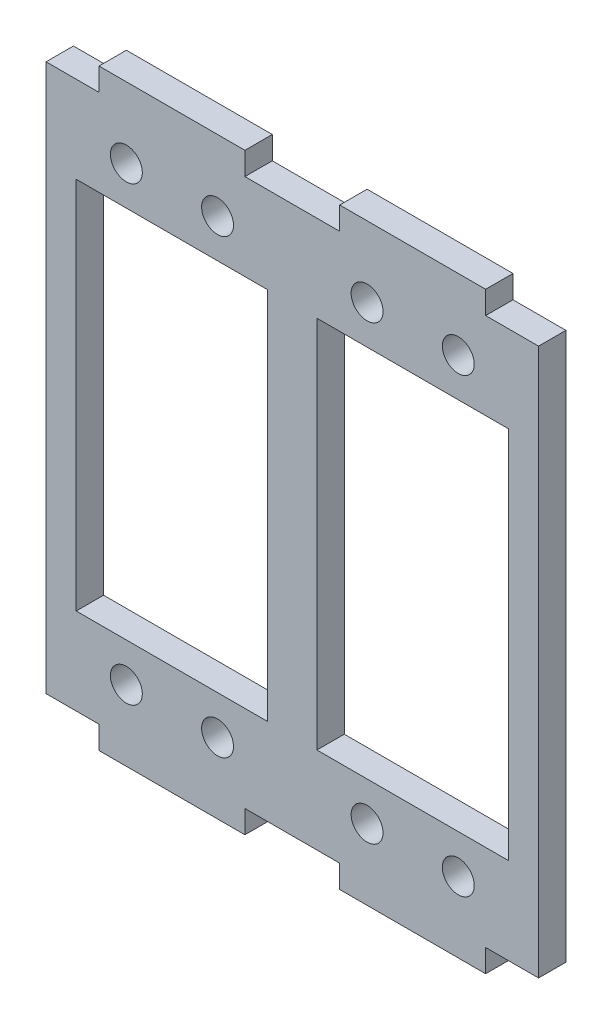
ISO-10303-21;
HEADER;
FILE_DESCRIPTION(('STEP AP214'),'2;1');
FILE_NAME('part.step','',(''),(''),'','','');
FILE_SCHEMA(('AUTOMOTIVE_DESIGN { 1 0 10303 214 1 1 1 1 }'));
ENDSEC;
DATA;
#1=APPLICATION_CONTEXT('core data for automotive mechanical design processes');
#2=APPLICATION_PROTOCOL_DEFINITION('international standard','automotive_design',2000,#1);
#3=PRODUCT_CONTEXT('',#1,'mechanical');
#4=PRODUCT('Part','Part','',(#3));
#5=PRODUCT_RELATED_PRODUCT_CATEGORY('part','',(#4));
#6=PRODUCT_DEFINITION_FORMATION('','',#4);
#7=PRODUCT_DEFINITION_CONTEXT('part definition',#1,'design');
#8=PRODUCT_DEFINITION('design','',#6,#7);
#9=PRODUCT_DEFINITION_SHAPE('','',#8);
#10=(LENGTH_UNIT() NAMED_UNIT(*) SI_UNIT(.MILLI.,.METRE.));
#11=(NAMED_UNIT(*) PLANE_ANGLE_UNIT() SI_UNIT($,.RADIAN.));
#12=(NAMED_UNIT(*) SI_UNIT($,.STERADIAN.) SOLID_ANGLE_UNIT());
#13=UNCERTAINTY_MEASURE_WITH_UNIT(LENGTH_MEASURE(1.E-05),#10,'distance_accuracy_value','');
#14=(GEOMETRIC_REPRESENTATION_CONTEXT(3) GLOBAL_UNCERTAINTY_ASSIGNED_CONTEXT((#13)) GLOBAL_UNIT_ASSIGNED_CONTEXT((#10,
#11,#12)) REPRESENTATION_CONTEXT('',''));
#15=CARTESIAN_POINT('',(0.,0.,0.));
#16=DIRECTION('',(0.,0.,1.));
#17=DIRECTION('',(1.,0.,0.));
#18=AXIS2_PLACEMENT_3D('',#15,#16,#17);
#19=CARTESIAN_POINT('',(0.,-30.6,-3.));
#20=DIRECTION('',(0.,1.,0.));
#21=DIRECTION('',(-1.,0.,0.));
#22=AXIS2_PLACEMENT_3D('',#19,#20,#21);
#23=PLANE('',#22);
#24=DIRECTION('',(-1.,0.,0.));
#25=VECTOR('',#24,1.);
#26=CARTESIAN_POINT('',(0.,-30.6,0.));
#27=LINE('',#26,#25);
#28=CARTESIAN_POINT('',(23.69729,-30.6,0.));
#29=VERTEX_POINT('',#28);
#30=CARTESIAN_POINT('',(2.69728999999997,-30.6,0.));
#31=VERTEX_POINT('',#30);
#32=EDGE_CURVE('E340',#29,#31,#27,.T.);
#33=ORIENTED_EDGE('',*,*,#32,.F.);
#34=DIRECTION('',(0.,0.,1.));
#35=VECTOR('',#34,1.);
#36=CARTESIAN_POINT('',(23.69729,-30.6,-3.));
#37=LINE('',#36,#35);
#38=CARTESIAN_POINT('',(23.69729,-30.6,-3.));
#39=VERTEX_POINT('',#38);
#40=EDGE_CURVE('E11',#39,#29,#37,.T.);
#41=ORIENTED_EDGE('',*,*,#40,.F.);
#42=DIRECTION('',(-1.,0.,0.));
#43=VECTOR('',#42,1.);
#44=CARTESIAN_POINT('',(0.,-30.6,-3.));
#45=LINE('',#44,#43);
#46=CARTESIAN_POINT('',(2.69728999999997,-30.6,-3.));
#47=VERTEX_POINT('',#46);
#48=EDGE_CURVE('E250',#39,#47,#45,.T.);
#49=ORIENTED_EDGE('',*,*,#48,.T.);
#50=DIRECTION('',(0.,0.,1.));
#51=VECTOR('',#50,1.);
#52=CARTESIAN_POINT('',(2.69728999999997,-30.6,-3.));
#53=LINE('',#52,#51);
#54=EDGE_CURVE('E247',#47,#31,#53,.T.);
#55=ORIENTED_EDGE('',*,*,#54,.T.);
#56=EDGE_LOOP('',(#33,#41,#49,#55));
#57=FACE_BOUND('',#56,.T.);
#58=ADVANCED_FACE('F38',(#57),#23,.T.);
#59=CARTESIAN_POINT('',(23.69729,0.,-3.));
#60=DIRECTION('',(1.,0.,0.));
#61=DIRECTION('',(0.,0.,-1.));
#62=AXIS2_PLACEMENT_3D('',#59,#60,#61);
#63=PLANE('',#62);
#64=DIRECTION('',(0.,1.,0.));
#65=VECTOR('',#64,1.);
#66=CARTESIAN_POINT('',(23.69729,0.,0.));
#67=LINE('',#66,#65);
#68=CARTESIAN_POINT('',(23.69729,10.4,0.));
#69=VERTEX_POINT('',#68);
#70=EDGE_CURVE('E346',#29,#69,#67,.T.);
#71=ORIENTED_EDGE('',*,*,#70,.T.);
#72=DIRECTION('',(0.,0.,1.));
#73=VECTOR('',#72,1.);
#74=CARTESIAN_POINT('',(23.69729,10.4,-3.));
#75=LINE('',#74,#73);
#76=CARTESIAN_POINT('',(23.69729,10.4,-3.));
#77=VERTEX_POINT('',#76);
#78=EDGE_CURVE('E48',#77,#69,#75,.T.);
#79=ORIENTED_EDGE('',*,*,#78,.F.);
#80=DIRECTION('',(0.,1.,0.));
#81=VECTOR('',#80,1.);
#82=CARTESIAN_POINT('',(23.69729,0.,-3.));
#83=LINE('',#82,#81);
#84=EDGE_CURVE('E239',#39,#77,#83,.T.);
#85=ORIENTED_EDGE('',*,*,#84,.F.);
#86=ORIENTED_EDGE('',*,*,#40,.T.);
#87=EDGE_LOOP('',(#71,#79,#85,#86));
#88=FACE_BOUND('',#87,.T.);
#89=ADVANCED_FACE('F558',(#88),#63,.F.);
#90=CARTESIAN_POINT('',(0.,10.4,-3.));
#91=DIRECTION('',(0.,1.,0.));
#92=DIRECTION('',(-1.,0.,0.));
#93=AXIS2_PLACEMENT_3D('',#90,#91,#92);
#94=PLANE('',#93);
#95=DIRECTION('',(-1.,0.,0.));
#96=VECTOR('',#95,1.);
#97=CARTESIAN_POINT('',(0.,10.4,0.));
#98=LINE('',#97,#96);
#99=CARTESIAN_POINT('',(2.69728999999997,10.4,0.));
#100=VERTEX_POINT('',#99);
#101=EDGE_CURVE('E145',#69,#100,#98,.T.);
#102=ORIENTED_EDGE('',*,*,#101,.T.);
#103=DIRECTION('',(0.,0.,1.));
#104=VECTOR('',#103,1.);
#105=CARTESIAN_POINT('',(2.69728999999997,10.4,-3.));
#106=LINE('',#105,#104);
#107=CARTESIAN_POINT('',(2.69728999999997,10.4,-3.));
#108=VERTEX_POINT('',#107);
#109=EDGE_CURVE('E243',#108,#100,#106,.T.);
#110=ORIENTED_EDGE('',*,*,#109,.F.);
#111=DIRECTION('',(-1.,0.,0.));
#112=VECTOR('',#111,1.);
#113=CARTESIAN_POINT('',(0.,10.4,-3.));
#114=LINE('',#113,#112);
#115=EDGE_CURVE('E233',#77,#108,#114,.T.);
#116=ORIENTED_EDGE('',*,*,#115,.F.);
#117=ORIENTED_EDGE('',*,*,#78,.T.);
#118=EDGE_LOOP('',(#102,#110,#116,#117));
#119=FACE_BOUND('',#118,.T.);
#120=ADVANCED_FACE('F244',(#119),#94,.F.);
#121=CARTESIAN_POINT('',(0.,-30.6,-3.));
#122=DIRECTION('',(0.,1.,0.));
#123=DIRECTION('',(-1.,0.,0.));
#124=AXIS2_PLACEMENT_3D('',#121,#122,#123);
#125=PLANE('',#124);
#126=DIRECTION('',(-1.,0.,0.));
#127=VECTOR('',#126,1.);
#128=CARTESIAN_POINT('',(0.,-30.6,0.));
#129=LINE('',#128,#127);
#130=CARTESIAN_POINT('',(-2.69729000000003,-30.6,0.));
#131=VERTEX_POINT('',#130);
#132=CARTESIAN_POINT('',(-23.69729,-30.6,0.));
#133=VERTEX_POINT('',#132);
#134=EDGE_CURVE('E328',#131,#133,#129,.T.);
#135=ORIENTED_EDGE('',*,*,#134,.F.);
#136=DIRECTION('',(0.,0.,1.));
#137=VECTOR('',#136,1.);
#138=CARTESIAN_POINT('',(-2.69729000000003,-30.6,-3.));
#139=LINE('',#138,#137);
#140=CARTESIAN_POINT('',(-2.69729000000003,-30.6,-3.));
#141=VERTEX_POINT('',#140);
#142=EDGE_CURVE('E351',#141,#131,#139,.T.);
#143=ORIENTED_EDGE('',*,*,#142,.F.);
#144=DIRECTION('',(-1.,0.,0.));
#145=VECTOR('',#144,1.);
#146=CARTESIAN_POINT('',(0.,-30.6,-3.));
#147=LINE('',#146,#145);
#148=CARTESIAN_POINT('',(-23.69729,-30.6,-3.));
#149=VERTEX_POINT('',#148);
#150=EDGE_CURVE('E448',#141,#149,#147,.T.);
#151=ORIENTED_EDGE('',*,*,#150,.T.);
#152=DIRECTION('',(0.,0.,1.));
#153=VECTOR('',#152,1.);
#154=CARTESIAN_POINT('',(-23.69729,-30.6,-3.));
#155=LINE('',#154,#153);
#156=EDGE_CURVE('E358',#149,#133,#155,.T.);
#157=ORIENTED_EDGE('',*,*,#156,.T.);
#158=EDGE_LOOP('',(#135,#143,#151,#157));
#159=FACE_BOUND('',#158,.T.);
#160=ADVANCED_FACE('F571',(#159),#125,.T.);
#161=CARTESIAN_POINT('',(-2.69729000000003,0.,-3.));
#162=DIRECTION('',(1.,0.,0.));
#163=DIRECTION('',(0.,0.,-1.));
#164=AXIS2_PLACEMENT_3D('',#161,#162,#163);
#165=PLANE('',#164);
#166=DIRECTION('',(0.,1.,0.));
#167=VECTOR('',#166,1.);
#168=CARTESIAN_POINT('',(-2.69729000000003,0.,0.));
#169=LINE('',#168,#167);
#170=CARTESIAN_POINT('',(-2.69729000000003,10.4,0.));
#171=VERTEX_POINT('',#170);
#172=EDGE_CURVE('E337',#131,#171,#169,.T.);
#173=ORIENTED_EDGE('',*,*,#172,.T.);
#174=DIRECTION('',(0.,0.,1.));
#175=VECTOR('',#174,1.);
#176=CARTESIAN_POINT('',(-2.69729000000003,10.4,-3.));
#177=LINE('',#176,#175);
#178=CARTESIAN_POINT('',(-2.69729000000003,10.4,-3.));
#179=VERTEX_POINT('',#178);
#180=EDGE_CURVE('E353',#179,#171,#177,.T.);
#181=ORIENTED_EDGE('',*,*,#180,.F.);
#182=DIRECTION('',(0.,1.,0.));
#183=VECTOR('',#182,1.);
#184=CARTESIAN_POINT('',(-2.69729000000003,0.,-3.));
#185=LINE('',#184,#183);
#186=EDGE_CURVE('E252',#141,#179,#185,.T.);
#187=ORIENTED_EDGE('',*,*,#186,.F.);
#188=ORIENTED_EDGE('',*,*,#142,.T.);
#189=EDGE_LOOP('',(#173,#181,#187,#188));
#190=FACE_BOUND('',#189,.T.);
#191=ADVANCED_FACE('F567',(#190),#165,.F.);
#192=CARTESIAN_POINT('',(0.,10.4,-3.));
#193=DIRECTION('',(0.,1.,0.));
#194=DIRECTION('',(-1.,0.,0.));
#195=AXIS2_PLACEMENT_3D('',#192,#193,#194);
#196=PLANE('',#195);
#197=DIRECTION('',(-1.,0.,0.));
#198=VECTOR('',#197,1.);
#199=CARTESIAN_POINT('',(0.,10.4,0.));
#200=LINE('',#199,#198);
#201=CARTESIAN_POINT('',(-23.69729,10.4,0.));
#202=VERTEX_POINT('',#201);
#203=EDGE_CURVE('E334',#171,#202,#200,.T.);
#204=ORIENTED_EDGE('',*,*,#203,.T.);
#205=DIRECTION('',(0.,0.,1.));
#206=VECTOR('',#205,1.);
#207=CARTESIAN_POINT('',(-23.69729,10.4,-3.));
#208=LINE('',#207,#206);
#209=CARTESIAN_POINT('',(-23.69729,10.4,-3.));
#210=VERTEX_POINT('',#209);
#211=EDGE_CURVE('E356',#210,#202,#208,.T.);
#212=ORIENTED_EDGE('',*,*,#211,.F.);
#213=DIRECTION('',(-1.,0.,0.));
#214=VECTOR('',#213,1.);
#215=CARTESIAN_POINT('',(0.,10.4,-3.));
#216=LINE('',#215,#214);
#217=EDGE_CURVE('E928',#179,#210,#216,.T.);
#218=ORIENTED_EDGE('',*,*,#217,.F.);
#219=ORIENTED_EDGE('',*,*,#180,.T.);
#220=EDGE_LOOP('',(#204,#212,#218,#219));
#221=FACE_BOUND('',#220,.T.);
#222=ADVANCED_FACE('F570',(#221),#196,.F.);
#223=CARTESIAN_POINT('',(-27.,0.,-3.));
#224=DIRECTION('',(1.,0.,0.));
#225=DIRECTION('',(0.,1.,0.));
#226=AXIS2_PLACEMENT_3D('',#223,#224,#225);
#227=PLANE('',#226);
#228=DIRECTION('',(0.,1.,0.));
#229=VECTOR('',#228,1.);
#230=CARTESIAN_POINT('',(-27.,0.,0.));
#231=LINE('',#230,#229);
#232=CARTESIAN_POINT('',(-27.,-40.1,0.));
#233=VERTEX_POINT('',#232);
#234=CARTESIAN_POINT('',(-27.,19.9,0.));
#235=VERTEX_POINT('',#234);
#236=EDGE_CURVE('E281',#233,#235,#231,.T.);
#237=ORIENTED_EDGE('',*,*,#236,.T.);
#238=DIRECTION('',(0.,0.,1.));
#239=VECTOR('',#238,1.);
#240=CARTESIAN_POINT('',(-27.,19.9,-3.));
#241=LINE('',#240,#239);
#242=CARTESIAN_POINT('',(-27.,19.9,-3.));
#243=VERTEX_POINT('',#242);
#244=EDGE_CURVE('E360',#243,#235,#241,.T.);
#245=ORIENTED_EDGE('',*,*,#244,.F.);
#246=DIRECTION('',(0.,1.,0.));
#247=VECTOR('',#246,1.);
#248=CARTESIAN_POINT('',(-27.,0.,-3.));
#249=LINE('',#248,#247);
#250=CARTESIAN_POINT('',(-27.,-40.1,-3.));
#251=VERTEX_POINT('',#250);
#252=EDGE_CURVE('E409',#251,#243,#249,.T.);
#253=ORIENTED_EDGE('',*,*,#252,.F.);
#254=DIRECTION('',(0.,0.,1.));
#255=VECTOR('',#254,1.);
#256=CARTESIAN_POINT('',(-27.,-40.1,-3.));
#257=LINE('',#256,#255);
#258=EDGE_CURVE('E42',#251,#233,#257,.T.);
#259=ORIENTED_EDGE('',*,*,#258,.T.);
#260=EDGE_LOOP('',(#237,#245,#253,#259));
#261=FACE_BOUND('',#260,.T.);
#262=ADVANCED_FACE('F406',(#261),#227,.F.);
#263=CARTESIAN_POINT('',(0.,19.9,-3.));
#264=DIRECTION('',(0.,1.,0.));
#265=DIRECTION('',(-1.,0.,0.));
#266=AXIS2_PLACEMENT_3D('',#263,#264,#265);
#267=PLANE('',#266);
#268=DIRECTION('',(-1.,0.,0.));
#269=VECTOR('',#268,1.);
#270=CARTESIAN_POINT('',(0.,19.9,0.));
#271=LINE('',#270,#269);
#272=CARTESIAN_POINT('',(-21.19729,19.9,0.));
#273=VERTEX_POINT('',#272);
#274=EDGE_CURVE('E313',#273,#235,#271,.T.);
#275=ORIENTED_EDGE('',*,*,#274,.F.);
#276=DIRECTION('',(0.,0.,1.));
#277=VECTOR('',#276,1.);
#278=CARTESIAN_POINT('',(-21.19729,19.9,-3.));
#279=LINE('',#278,#277);
#280=CARTESIAN_POINT('',(-21.19729,19.9,-3.));
#281=VERTEX_POINT('',#280);
#282=EDGE_CURVE('E362',#281,#273,#279,.T.);
#283=ORIENTED_EDGE('',*,*,#282,.F.);
#284=DIRECTION('',(-1.,0.,0.));
#285=VECTOR('',#284,1.);
#286=CARTESIAN_POINT('',(0.,19.9,-3.));
#287=LINE('',#286,#285);
#288=EDGE_CURVE('E447',#281,#243,#287,.T.);
#289=ORIENTED_EDGE('',*,*,#288,.T.);
#290=ORIENTED_EDGE('',*,*,#244,.T.);
#291=EDGE_LOOP('',(#275,#283,#289,#290));
#292=FACE_BOUND('',#291,.T.);
#293=ADVANCED_FACE('F446',(#292),#267,.T.);
#294=CARTESIAN_POINT('',(-21.19729,0.,-3.));
#295=DIRECTION('',(1.,0.,0.));
#296=DIRECTION('',(0.,0.,-1.));
#297=AXIS2_PLACEMENT_3D('',#294,#295,#296);
#298=PLANE('',#297);
#299=DIRECTION('',(0.,1.,0.));
#300=VECTOR('',#299,1.);
#301=CARTESIAN_POINT('',(-21.19729,0.,0.));
#302=LINE('',#301,#300);
#303=CARTESIAN_POINT('',(-21.19729,22.4,0.));
#304=VERTEX_POINT('',#303);
#305=EDGE_CURVE('E326',#273,#304,#302,.T.);
#306=ORIENTED_EDGE('',*,*,#305,.T.);
#307=DIRECTION('',(0.,0.,1.));
#308=VECTOR('',#307,1.);
#309=CARTESIAN_POINT('',(-21.19729,22.4,-3.));
#310=LINE('',#309,#308);
#311=CARTESIAN_POINT('',(-21.19729,22.4,-3.));
#312=VERTEX_POINT('',#311);
#313=EDGE_CURVE('E364',#312,#304,#310,.T.);
#314=ORIENTED_EDGE('',*,*,#313,.F.);
#315=DIRECTION('',(0.,1.,0.));
#316=VECTOR('',#315,1.);
#317=CARTESIAN_POINT('',(-21.19729,0.,-3.));
#318=LINE('',#317,#316);
#319=EDGE_CURVE('E443',#281,#312,#318,.T.);
#320=ORIENTED_EDGE('',*,*,#319,.F.);
#321=ORIENTED_EDGE('',*,*,#282,.T.);
#322=EDGE_LOOP('',(#306,#314,#320,#321));
#323=FACE_BOUND('',#322,.T.);
#324=ADVANCED_FACE('F442',(#323),#298,.F.);
#325=CARTESIAN_POINT('',(0.,22.4,-3.));
#326=DIRECTION('',(0.,-1.,0.));
#327=DIRECTION('',(0.,0.,-1.));
#328=AXIS2_PLACEMENT_3D('',#325,#326,#327);
#329=PLANE('',#328);
#330=DIRECTION('',(1.,0.,0.));
#331=VECTOR('',#330,1.);
#332=CARTESIAN_POINT('',(0.,22.4,0.));
#333=LINE('',#332,#331);
#334=CARTESIAN_POINT('',(-5.19729000000003,22.4,0.));
#335=VERTEX_POINT('',#334);
#336=EDGE_CURVE('E324',#304,#335,#333,.T.);
#337=ORIENTED_EDGE('',*,*,#336,.T.);
#338=DIRECTION('',(0.,0.,1.));
#339=VECTOR('',#338,1.);
#340=CARTESIAN_POINT('',(-5.19729000000003,22.4,-3.));
#341=LINE('',#340,#339);
#342=CARTESIAN_POINT('',(-5.19729000000003,22.4,-3.));
#343=VERTEX_POINT('',#342);
#344=EDGE_CURVE('E367',#343,#335,#341,.T.);
#345=ORIENTED_EDGE('',*,*,#344,.F.);
#346=DIRECTION('',(1.,0.,0.));
#347=VECTOR('',#346,1.);
#348=CARTESIAN_POINT('',(0.,22.4,-3.));
#349=LINE('',#348,#347);
#350=EDGE_CURVE('E438',#312,#343,#349,.T.);
#351=ORIENTED_EDGE('',*,*,#350,.F.);
#352=ORIENTED_EDGE('',*,*,#313,.T.);
#353=EDGE_LOOP('',(#337,#345,#351,#352));
#354=FACE_BOUND('',#353,.T.);
#355=ADVANCED_FACE('F437',(#354),#329,.F.);
#356=CARTESIAN_POINT('',(-5.19729000000003,0.,-3.));
#357=DIRECTION('',(-1.,0.,0.));
#358=DIRECTION('',(0.,0.,1.));
#359=AXIS2_PLACEMENT_3D('',#356,#357,#358);
#360=PLANE('',#359);
#361=DIRECTION('',(0.,-1.,0.));
#362=VECTOR('',#361,1.);
#363=CARTESIAN_POINT('',(-5.19729000000003,0.,0.));
#364=LINE('',#363,#362);
#365=CARTESIAN_POINT('',(-5.19729000000003,19.9,0.));
#366=VERTEX_POINT('',#365);
#367=EDGE_CURVE('E321',#335,#366,#364,.T.);
#368=ORIENTED_EDGE('',*,*,#367,.T.);
#369=DIRECTION('',(0.,0.,1.));
#370=VECTOR('',#369,1.);
#371=CARTESIAN_POINT('',(-5.19729000000003,19.9,-3.));
#372=LINE('',#371,#370);
#373=CARTESIAN_POINT('',(-5.19729000000003,19.9,-3.));
#374=VERTEX_POINT('',#373);
#375=EDGE_CURVE('E370',#374,#366,#372,.T.);
#376=ORIENTED_EDGE('',*,*,#375,.F.);
#377=DIRECTION('',(0.,-1.,0.));
#378=VECTOR('',#377,1.);
#379=CARTESIAN_POINT('',(-5.19729000000003,0.,-3.));
#380=LINE('',#379,#378);
#381=EDGE_CURVE('E434',#343,#374,#380,.T.);
#382=ORIENTED_EDGE('',*,*,#381,.F.);
#383=ORIENTED_EDGE('',*,*,#344,.T.);
#384=EDGE_LOOP('',(#368,#376,#382,#383));
#385=FACE_BOUND('',#384,.T.);
#386=ADVANCED_FACE('F432',(#385),#360,.F.);
#387=CARTESIAN_POINT('',(5.19728999999997,19.9,0.));
#388=VERTEX_POINT('',#387);
#389=EDGE_CURVE('E314',#388,#366,#271,.T.);
#390=ORIENTED_EDGE('',*,*,#389,.F.);
#391=DIRECTION('',(0.,0.,1.));
#392=VECTOR('',#391,1.);
#393=CARTESIAN_POINT('',(5.19728999999997,19.9,-3.));
#394=LINE('',#393,#392);
#395=CARTESIAN_POINT('',(5.19728999999997,19.9,-3.));
#396=VERTEX_POINT('',#395);
#397=EDGE_CURVE('E372',#396,#388,#394,.T.);
#398=ORIENTED_EDGE('',*,*,#397,.F.);
#399=EDGE_CURVE('E429',#396,#374,#287,.T.);
#400=ORIENTED_EDGE('',*,*,#399,.T.);
#401=ORIENTED_EDGE('',*,*,#375,.T.);
#402=EDGE_LOOP('',(#390,#398,#400,#401));
#403=FACE_BOUND('',#402,.T.);
#404=ADVANCED_FACE('F424',(#403),#267,.T.);
#405=CARTESIAN_POINT('',(5.19728999999997,0.,-3.));
#406=DIRECTION('',(1.,0.,0.));
#407=DIRECTION('',(0.,0.,-1.));
#408=AXIS2_PLACEMENT_3D('',#405,#406,#407);
#409=PLANE('',#408);
#410=DIRECTION('',(0.,1.,0.));
#411=VECTOR('',#410,1.);
#412=CARTESIAN_POINT('',(5.19728999999997,0.,0.));
#413=LINE('',#412,#411);
#414=CARTESIAN_POINT('',(5.19728999999997,22.4,0.));
#415=VERTEX_POINT('',#414);
#416=EDGE_CURVE('E319',#388,#415,#413,.T.);
#417=ORIENTED_EDGE('',*,*,#416,.T.);
#418=DIRECTION('',(0.,0.,1.));
#419=VECTOR('',#418,1.);
#420=CARTESIAN_POINT('',(5.19728999999997,22.4,-3.));
#421=LINE('',#420,#419);
#422=CARTESIAN_POINT('',(5.19728999999997,22.4,-3.));
#423=VERTEX_POINT('',#422);
#424=EDGE_CURVE('E374',#423,#415,#421,.T.);
#425=ORIENTED_EDGE('',*,*,#424,.F.);
#426=DIRECTION('',(0.,1.,0.));
#427=VECTOR('',#426,1.);
#428=CARTESIAN_POINT('',(5.19728999999997,0.,-3.));
#429=LINE('',#428,#427);
#430=EDGE_CURVE('E457',#396,#423,#429,.T.);
#431=ORIENTED_EDGE('',*,*,#430,.F.);
#432=ORIENTED_EDGE('',*,*,#397,.T.);
#433=EDGE_LOOP('',(#417,#425,#431,#432));
#434=FACE_BOUND('',#433,.T.);
#435=ADVANCED_FACE('F592',(#434),#409,.F.);
#436=CARTESIAN_POINT('',(0.,22.4,-3.));
#437=DIRECTION('',(0.,-1.,0.));
#438=DIRECTION('',(1.,0.,0.));
#439=AXIS2_PLACEMENT_3D('',#436,#437,#438);
#440=PLANE('',#439);
#441=DIRECTION('',(1.,0.,0.));
#442=VECTOR('',#441,1.);
#443=CARTESIAN_POINT('',(0.,22.4,0.));
#444=LINE('',#443,#442);
#445=CARTESIAN_POINT('',(21.19729,22.4,0.));
#446=VERTEX_POINT('',#445);
#447=EDGE_CURVE('E317',#415,#446,#444,.T.);
#448=ORIENTED_EDGE('',*,*,#447,.T.);
#449=DIRECTION('',(0.,0.,1.));
#450=VECTOR('',#449,1.);
#451=CARTESIAN_POINT('',(21.19729,22.4,-3.));
#452=LINE('',#451,#450);
#453=CARTESIAN_POINT('',(21.19729,22.4,-3.));
#454=VERTEX_POINT('',#453);
#455=EDGE_CURVE('E377',#454,#446,#452,.T.);
#456=ORIENTED_EDGE('',*,*,#455,.F.);
#457=DIRECTION('',(1.,0.,0.));
#458=VECTOR('',#457,1.);
#459=CARTESIAN_POINT('',(0.,22.4,-3.));
#460=LINE('',#459,#458);
#461=EDGE_CURVE('E463',#423,#454,#460,.T.);
#462=ORIENTED_EDGE('',*,*,#461,.F.);
#463=ORIENTED_EDGE('',*,*,#424,.T.);
#464=EDGE_LOOP('',(#448,#456,#462,#463));
#465=FACE_BOUND('',#464,.T.);
#466=ADVANCED_FACE('F595',(#465),#440,.F.);
#467=CARTESIAN_POINT('',(21.19729,0.,-3.));
#468=DIRECTION('',(-1.,0.,0.));
#469=DIRECTION('',(0.,0.,1.));
#470=AXIS2_PLACEMENT_3D('',#467,#468,#469);
#471=PLANE('',#470);
#472=DIRECTION('',(0.,-1.,0.));
#473=VECTOR('',#472,1.);
#474=CARTESIAN_POINT('',(21.19729,0.,0.));
#475=LINE('',#474,#473);
#476=CARTESIAN_POINT('',(21.19729,19.9,0.));
#477=VERTEX_POINT('',#476);
#478=EDGE_CURVE('E312',#446,#477,#475,.T.);
#479=ORIENTED_EDGE('',*,*,#478,.T.);
#480=DIRECTION('',(0.,0.,1.));
#481=VECTOR('',#480,1.);
#482=CARTESIAN_POINT('',(21.19729,19.9,-3.));
#483=LINE('',#482,#481);
#484=CARTESIAN_POINT('',(21.19729,19.9,-3.));
#485=VERTEX_POINT('',#484);
#486=EDGE_CURVE('E380',#485,#477,#483,.T.);
#487=ORIENTED_EDGE('',*,*,#486,.F.);
#488=DIRECTION('',(0.,-1.,0.));
#489=VECTOR('',#488,1.);
#490=CARTESIAN_POINT('',(21.19729,0.,-3.));
#491=LINE('',#490,#489);
#492=EDGE_CURVE('E459',#454,#485,#491,.T.);
#493=ORIENTED_EDGE('',*,*,#492,.F.);
#494=ORIENTED_EDGE('',*,*,#455,.T.);
#495=EDGE_LOOP('',(#479,#487,#493,#494));
#496=FACE_BOUND('',#495,.T.);
#497=ADVANCED_FACE('F599',(#496),#471,.F.);
#498=CARTESIAN_POINT('',(27.,19.9,0.));
#499=VERTEX_POINT('',#498);
#500=EDGE_CURVE('E309',#499,#477,#271,.T.);
#501=ORIENTED_EDGE('',*,*,#500,.F.);
#502=DIRECTION('',(0.,0.,1.));
#503=VECTOR('',#502,1.);
#504=CARTESIAN_POINT('',(27.,19.9,-3.));
#505=LINE('',#504,#503);
#506=CARTESIAN_POINT('',(27.,19.9,-3.));
#507=VERTEX_POINT('',#506);
#508=EDGE_CURVE('E382',#507,#499,#505,.T.);
#509=ORIENTED_EDGE('',*,*,#508,.F.);
#510=EDGE_CURVE('E450',#507,#485,#287,.T.);
#511=ORIENTED_EDGE('',*,*,#510,.T.);
#512=ORIENTED_EDGE('',*,*,#486,.T.);
#513=EDGE_LOOP('',(#501,#509,#511,#512));
#514=FACE_BOUND('',#513,.T.);
#515=ADVANCED_FACE('F585',(#514),#267,.T.);
#516=CARTESIAN_POINT('',(27.,0.,-3.));
#517=DIRECTION('',(1.,0.,0.));
#518=DIRECTION('',(0.,1.,0.));
#519=AXIS2_PLACEMENT_3D('',#516,#517,#518);
#520=PLANE('',#519);
#521=DIRECTION('',(0.,1.,0.));
#522=VECTOR('',#521,1.);
#523=CARTESIAN_POINT('',(27.,0.,0.));
#524=LINE('',#523,#522);
#525=CARTESIAN_POINT('',(27.,-40.1,0.));
#526=VERTEX_POINT('',#525);
#527=EDGE_CURVE('E306',#526,#499,#524,.T.);
#528=ORIENTED_EDGE('',*,*,#527,.F.);
#529=DIRECTION('',(0.,0.,1.));
#530=VECTOR('',#529,1.);
#531=CARTESIAN_POINT('',(27.,-40.1,-3.));
#532=LINE('',#531,#530);
#533=CARTESIAN_POINT('',(27.,-40.1,-3.));
#534=VERTEX_POINT('',#533);
#535=EDGE_CURVE('E384',#534,#526,#532,.T.);
#536=ORIENTED_EDGE('',*,*,#535,.F.);
#537=DIRECTION('',(0.,1.,0.));
#538=VECTOR('',#537,1.);
#539=CARTESIAN_POINT('',(27.,0.,-3.));
#540=LINE('',#539,#538);
#541=EDGE_CURVE('E460',#534,#507,#540,.T.);
#542=ORIENTED_EDGE('',*,*,#541,.T.);
#543=ORIENTED_EDGE('',*,*,#508,.T.);
#544=EDGE_LOOP('',(#528,#536,#542,#543));
#545=FACE_BOUND('',#544,.T.);
#546=ADVANCED_FACE('F604',(#545),#520,.T.);
#547=CARTESIAN_POINT('',(0.,-40.1,-3.));
#548=DIRECTION('',(0.,1.,0.));
#549=DIRECTION('',(-1.,0.,0.));
#550=AXIS2_PLACEMENT_3D('',#547,#548,#549);
#551=PLANE('',#550);
#552=DIRECTION('',(-1.,0.,0.));
#553=VECTOR('',#552,1.);
#554=CARTESIAN_POINT('',(0.,-40.1,0.));
#555=LINE('',#554,#553);
#556=CARTESIAN_POINT('',(21.19729,-40.1,0.));
#557=VERTEX_POINT('',#556);
#558=EDGE_CURVE('E287',#526,#557,#555,.T.);
#559=ORIENTED_EDGE('',*,*,#558,.T.);
#560=DIRECTION('',(0.,0.,1.));
#561=VECTOR('',#560,1.);
#562=CARTESIAN_POINT('',(21.19729,-40.1,-3.));
#563=LINE('',#562,#561);
#564=CARTESIAN_POINT('',(21.19729,-40.1,-3.));
#565=VERTEX_POINT('',#564);
#566=EDGE_CURVE('E386',#565,#557,#563,.T.);
#567=ORIENTED_EDGE('',*,*,#566,.F.);
#568=DIRECTION('',(-1.,0.,0.));
#569=VECTOR('',#568,1.);
#570=CARTESIAN_POINT('',(0.,-40.1,-3.));
#571=LINE('',#570,#569);
#572=EDGE_CURVE('E465',#534,#565,#571,.T.);
#573=ORIENTED_EDGE('',*,*,#572,.F.);
#574=ORIENTED_EDGE('',*,*,#535,.T.);
#575=EDGE_LOOP('',(#559,#567,#573,#574));
#576=FACE_BOUND('',#575,.T.);
#577=ADVANCED_FACE('F554',(#576),#551,.F.);
#578=CARTESIAN_POINT('',(21.19729,0.,-3.));
#579=DIRECTION('',(1.,0.,0.));
#580=DIRECTION('',(0.,0.,-1.));
#581=AXIS2_PLACEMENT_3D('',#578,#579,#580);
#582=PLANE('',#581);
#583=DIRECTION('',(0.,1.,0.));
#584=VECTOR('',#583,1.);
#585=CARTESIAN_POINT('',(21.19729,0.,0.));
#586=LINE('',#585,#584);
#587=CARTESIAN_POINT('',(21.19729,-42.6,0.));
#588=VERTEX_POINT('',#587);
#589=EDGE_CURVE('E303',#588,#557,#586,.T.);
#590=ORIENTED_EDGE('',*,*,#589,.F.);
#591=DIRECTION('',(0.,0.,1.));
#592=VECTOR('',#591,1.);
#593=CARTESIAN_POINT('',(21.19729,-42.6,-3.));
#594=LINE('',#593,#592);
#595=CARTESIAN_POINT('',(21.19729,-42.6,-3.));
#596=VERTEX_POINT('',#595);
#597=EDGE_CURVE('E388',#596,#588,#594,.T.);
#598=ORIENTED_EDGE('',*,*,#597,.F.);
#599=DIRECTION('',(0.,1.,0.));
#600=VECTOR('',#599,1.);
#601=CARTESIAN_POINT('',(21.19729,0.,-3.));
#602=LINE('',#601,#600);
#603=EDGE_CURVE('E468',#596,#565,#602,.T.);
#604=ORIENTED_EDGE('',*,*,#603,.T.);
#605=ORIENTED_EDGE('',*,*,#566,.T.);
#606=EDGE_LOOP('',(#590,#598,#604,#605));
#607=FACE_BOUND('',#606,.T.);
#608=ADVANCED_FACE('F608',(#607),#582,.T.);
#609=CARTESIAN_POINT('',(0.,-42.6,-3.));
#610=DIRECTION('',(0.,-1.,0.));
#611=DIRECTION('',(0.,0.,-1.));
#612=AXIS2_PLACEMENT_3D('',#609,#610,#611);
#613=PLANE('',#612);
#614=DIRECTION('',(1.,0.,0.));
#615=VECTOR('',#614,1.);
#616=CARTESIAN_POINT('',(0.,-42.6,0.));
#617=LINE('',#616,#615);
#618=CARTESIAN_POINT('',(5.19728999999997,-42.6,0.));
#619=VERTEX_POINT('',#618);
#620=EDGE_CURVE('E300',#619,#588,#617,.T.);
#621=ORIENTED_EDGE('',*,*,#620,.F.);
#622=DIRECTION('',(0.,0.,1.));
#623=VECTOR('',#622,1.);
#624=CARTESIAN_POINT('',(5.19728999999997,-42.6,-3.));
#625=LINE('',#624,#623);
#626=CARTESIAN_POINT('',(5.19728999999997,-42.6,-3.));
#627=VERTEX_POINT('',#626);
#628=EDGE_CURVE('E390',#627,#619,#625,.T.);
#629=ORIENTED_EDGE('',*,*,#628,.F.);
#630=DIRECTION('',(1.,0.,0.));
#631=VECTOR('',#630,1.);
#632=CARTESIAN_POINT('',(0.,-42.6,-3.));
#633=LINE('',#632,#631);
#634=EDGE_CURVE('E474',#627,#596,#633,.T.);
#635=ORIENTED_EDGE('',*,*,#634,.T.);
#636=ORIENTED_EDGE('',*,*,#597,.T.);
#637=EDGE_LOOP('',(#621,#629,#635,#636));
#638=FACE_BOUND('',#637,.T.);
#639=ADVANCED_FACE('F612',(#638),#613,.T.);
#640=CARTESIAN_POINT('',(5.19728999999997,0.,-3.));
#641=DIRECTION('',(-1.,0.,0.));
#642=DIRECTION('',(0.,0.,1.));
#643=AXIS2_PLACEMENT_3D('',#640,#641,#642);
#644=PLANE('',#643);
#645=DIRECTION('',(0.,-1.,0.));
#646=VECTOR('',#645,1.);
#647=CARTESIAN_POINT('',(5.19728999999997,0.,0.));
#648=LINE('',#647,#646);
#649=CARTESIAN_POINT('',(5.19728999999997,-40.1,0.));
#650=VERTEX_POINT('',#649);
#651=EDGE_CURVE('E297',#650,#619,#648,.T.);
#652=ORIENTED_EDGE('',*,*,#651,.F.);
#653=DIRECTION('',(0.,0.,1.));
#654=VECTOR('',#653,1.);
#655=CARTESIAN_POINT('',(5.19728999999997,-40.1,-3.));
#656=LINE('',#655,#654);
#657=CARTESIAN_POINT('',(5.19728999999997,-40.1,-3.));
#658=VERTEX_POINT('',#657);
#659=EDGE_CURVE('E392',#658,#650,#656,.T.);
#660=ORIENTED_EDGE('',*,*,#659,.F.);
#661=DIRECTION('',(0.,-1.,0.));
#662=VECTOR('',#661,1.);
#663=CARTESIAN_POINT('',(5.19728999999997,0.,-3.));
#664=LINE('',#663,#662);
#665=EDGE_CURVE('E477',#658,#627,#664,.T.);
#666=ORIENTED_EDGE('',*,*,#665,.T.);
#667=ORIENTED_EDGE('',*,*,#628,.T.);
#668=EDGE_LOOP('',(#652,#660,#666,#667));
#669=FACE_BOUND('',#668,.T.);
#670=ADVANCED_FACE('F616',(#669),#644,.T.);
#671=CARTESIAN_POINT('',(-5.19729000000003,-40.1,0.));
#672=VERTEX_POINT('',#671);
#673=EDGE_CURVE('E288',#650,#672,#555,.T.);
#674=ORIENTED_EDGE('',*,*,#673,.T.);
#675=DIRECTION('',(0.,0.,1.));
#676=VECTOR('',#675,1.);
#677=CARTESIAN_POINT('',(-5.19729000000003,-40.1,-3.));
#678=LINE('',#677,#676);
#679=CARTESIAN_POINT('',(-5.19729000000003,-40.1,-3.));
#680=VERTEX_POINT('',#679);
#681=EDGE_CURVE('E394',#680,#672,#678,.T.);
#682=ORIENTED_EDGE('',*,*,#681,.F.);
#683=EDGE_CURVE('E470',#658,#680,#571,.T.);
#684=ORIENTED_EDGE('',*,*,#683,.F.);
#685=ORIENTED_EDGE('',*,*,#659,.T.);
#686=EDGE_LOOP('',(#674,#682,#684,#685));
#687=FACE_BOUND('',#686,.T.);
#688=ADVANCED_FACE('F553',(#687),#551,.F.);
#689=CARTESIAN_POINT('',(-5.19729000000003,0.,-3.));
#690=DIRECTION('',(1.,0.,0.));
#691=DIRECTION('',(0.,0.,-1.));
#692=AXIS2_PLACEMENT_3D('',#689,#690,#691);
#693=PLANE('',#692);
#694=DIRECTION('',(0.,1.,0.));
#695=VECTOR('',#694,1.);
#696=CARTESIAN_POINT('',(-5.19729000000003,0.,0.));
#697=LINE('',#696,#695);
#698=CARTESIAN_POINT('',(-5.19729000000003,-42.6,0.));
#699=VERTEX_POINT('',#698);
#700=EDGE_CURVE('E294',#699,#672,#697,.T.);
#701=ORIENTED_EDGE('',*,*,#700,.F.);
#702=DIRECTION('',(0.,0.,1.));
#703=VECTOR('',#702,1.);
#704=CARTESIAN_POINT('',(-5.19729000000003,-42.6,-3.));
#705=LINE('',#704,#703);
#706=CARTESIAN_POINT('',(-5.19729000000003,-42.6,-3.));
#707=VERTEX_POINT('',#706);
#708=EDGE_CURVE('E396',#707,#699,#705,.T.);
#709=ORIENTED_EDGE('',*,*,#708,.F.);
#710=DIRECTION('',(0.,1.,0.));
#711=VECTOR('',#710,1.);
#712=CARTESIAN_POINT('',(-5.19729000000003,0.,-3.));
#713=LINE('',#712,#711);
#714=EDGE_CURVE('E480',#707,#680,#713,.T.);
#715=ORIENTED_EDGE('',*,*,#714,.T.);
#716=ORIENTED_EDGE('',*,*,#681,.T.);
#717=EDGE_LOOP('',(#701,#709,#715,#716));
#718=FACE_BOUND('',#717,.T.);
#719=ADVANCED_FACE('F621',(#718),#693,.T.);
#720=CARTESIAN_POINT('',(0.,-42.6,-3.));
#721=DIRECTION('',(0.,-1.,0.));
#722=DIRECTION('',(0.,0.,-1.));
#723=AXIS2_PLACEMENT_3D('',#720,#721,#722);
#724=PLANE('',#723);
#725=DIRECTION('',(1.,0.,0.));
#726=VECTOR('',#725,1.);
#727=CARTESIAN_POINT('',(0.,-42.6,0.));
#728=LINE('',#727,#726);
#729=CARTESIAN_POINT('',(-21.19729,-42.6,0.));
#730=VERTEX_POINT('',#729);
#731=EDGE_CURVE('E291',#730,#699,#728,.T.);
#732=ORIENTED_EDGE('',*,*,#731,.F.);
#733=DIRECTION('',(0.,0.,1.));
#734=VECTOR('',#733,1.);
#735=CARTESIAN_POINT('',(-21.19729,-42.6,-3.));
#736=LINE('',#735,#734);
#737=CARTESIAN_POINT('',(-21.19729,-42.6,-3.));
#738=VERTEX_POINT('',#737);
#739=EDGE_CURVE('E398',#738,#730,#736,.T.);
#740=ORIENTED_EDGE('',*,*,#739,.F.);
#741=DIRECTION('',(1.,0.,0.));
#742=VECTOR('',#741,1.);
#743=CARTESIAN_POINT('',(0.,-42.6,-3.));
#744=LINE('',#743,#742);
#745=EDGE_CURVE('E483',#738,#707,#744,.T.);
#746=ORIENTED_EDGE('',*,*,#745,.T.);
#747=ORIENTED_EDGE('',*,*,#708,.T.);
#748=EDGE_LOOP('',(#732,#740,#746,#747));
#749=FACE_BOUND('',#748,.T.);
#750=ADVANCED_FACE('F624',(#749),#724,.T.);
#751=CARTESIAN_POINT('',(-21.19729,0.,-3.));
#752=DIRECTION('',(-1.,0.,0.));
#753=DIRECTION('',(0.,0.,1.));
#754=AXIS2_PLACEMENT_3D('',#751,#752,#753);
#755=PLANE('',#754);
#756=DIRECTION('',(0.,-1.,0.));
#757=VECTOR('',#756,1.);
#758=CARTESIAN_POINT('',(-21.19729,0.,0.));
#759=LINE('',#758,#757);
#760=CARTESIAN_POINT('',(-21.19729,-40.1,0.));
#761=VERTEX_POINT('',#760);
#762=EDGE_CURVE('E286',#761,#730,#759,.T.);
#763=ORIENTED_EDGE('',*,*,#762,.F.);
#764=DIRECTION('',(0.,0.,1.));
#765=VECTOR('',#764,1.);
#766=CARTESIAN_POINT('',(-21.19729,-40.1,-3.));
#767=LINE('',#766,#765);
#768=CARTESIAN_POINT('',(-21.19729,-40.1,-3.));
#769=VERTEX_POINT('',#768);
#770=EDGE_CURVE('E399',#769,#761,#767,.T.);
#771=ORIENTED_EDGE('',*,*,#770,.F.);
#772=DIRECTION('',(0.,-1.,0.));
#773=VECTOR('',#772,1.);
#774=CARTESIAN_POINT('',(-21.19729,0.,-3.));
#775=LINE('',#774,#773);
#776=EDGE_CURVE('E486',#769,#738,#775,.T.);
#777=ORIENTED_EDGE('',*,*,#776,.T.);
#778=ORIENTED_EDGE('',*,*,#739,.T.);
#779=EDGE_LOOP('',(#763,#771,#777,#778));
#780=FACE_BOUND('',#779,.T.);
#781=ADVANCED_FACE('F578',(#780),#755,.T.);
#782=CARTESIAN_POINT('',(-23.69729,0.,-3.));
#783=DIRECTION('',(1.,0.,0.));
#784=DIRECTION('',(0.,0.,-1.));
#785=AXIS2_PLACEMENT_3D('',#782,#783,#784);
#786=PLANE('',#785);
#787=DIRECTION('',(0.,1.,0.));
#788=VECTOR('',#787,1.);
#789=CARTESIAN_POINT('',(-23.69729,0.,0.));
#790=LINE('',#789,#788);
#791=EDGE_CURVE('E331',#133,#202,#790,.T.);
#792=ORIENTED_EDGE('',*,*,#791,.F.);
#793=ORIENTED_EDGE('',*,*,#156,.F.);
#794=DIRECTION('',(0.,1.,0.));
#795=VECTOR('',#794,1.);
#796=CARTESIAN_POINT('',(-23.69729,0.,-3.));
#797=LINE('',#796,#795);
#798=EDGE_CURVE('E452',#149,#210,#797,.T.);
#799=ORIENTED_EDGE('',*,*,#798,.T.);
#800=ORIENTED_EDGE('',*,*,#211,.T.);
#801=EDGE_LOOP('',(#792,#793,#799,#800));
#802=FACE_BOUND('',#801,.T.);
#803=ADVANCED_FACE('F551',(#802),#786,.T.);
#804=EDGE_CURVE('E284',#761,#233,#555,.T.);
#805=ORIENTED_EDGE('',*,*,#804,.T.);
#806=ORIENTED_EDGE('',*,*,#258,.F.);
#807=EDGE_CURVE('E157',#769,#251,#571,.T.);
#808=ORIENTED_EDGE('',*,*,#807,.F.);
#809=ORIENTED_EDGE('',*,*,#770,.T.);
#810=EDGE_LOOP('',(#805,#806,#808,#809));
#811=FACE_BOUND('',#810,.T.);
#812=ADVANCED_FACE('F541',(#811),#551,.F.);
#813=CARTESIAN_POINT('',(-18.19729,-34.85,-3.));
#814=DIRECTION('',(0.,0.,1.));
#815=DIRECTION('',(1.,0.,0.));
#816=AXIS2_PLACEMENT_3D('',#813,#814,#815);
#817=CYLINDRICAL_SURFACE('',#816,1.75);
#818=CARTESIAN_POINT('',(-18.19729,-34.85,-3.));
#819=DIRECTION('',(0.,0.,1.));
#820=DIRECTION('',(1.,0.,0.));
#821=AXIS2_PLACEMENT_3D('',#818,#819,#820);
#822=CIRCLE('',#821,1.75);
#823=CARTESIAN_POINT('',(-16.44729,-34.85,-3.));
#824=VERTEX_POINT('',#823);
#825=EDGE_CURVE('E490',#824,#824,#822,.T.);
#826=ORIENTED_EDGE('',*,*,#825,.F.);
#827=EDGE_LOOP('',(#826));
#828=FACE_BOUND('',#827,.T.);
#829=CARTESIAN_POINT('',(-18.19729,-34.85,0.));
#830=DIRECTION('',(0.,0.,1.));
#831=DIRECTION('',(1.,0.,0.));
#832=AXIS2_PLACEMENT_3D('',#829,#830,#831);
#833=CIRCLE('',#832,1.75);
#834=CARTESIAN_POINT('',(-16.44729,-34.85,0.));
#835=VERTEX_POINT('',#834);
#836=EDGE_CURVE('E278',#835,#835,#833,.T.);
#837=ORIENTED_EDGE('',*,*,#836,.T.);
#838=EDGE_LOOP('',(#837));
#839=FACE_BOUND('',#838,.T.);
#840=ADVANCED_FACE('F538',(#828,#839),#817,.F.);
#841=CARTESIAN_POINT('',(-8.197262,-34.85,-3.));
#842=DIRECTION('',(0.,0.,1.));
#843=DIRECTION('',(1.,0.,0.));
#844=AXIS2_PLACEMENT_3D('',#841,#842,#843);
#845=CYLINDRICAL_SURFACE('',#844,1.75);
#846=CARTESIAN_POINT('',(-8.197262,-34.85,-3.));
#847=DIRECTION('',(0.,0.,1.));
#848=DIRECTION('',(1.,0.,0.));
#849=AXIS2_PLACEMENT_3D('',#846,#847,#848);
#850=CIRCLE('',#849,1.75);
#851=CARTESIAN_POINT('',(-6.447262,-34.85,-3.));
#852=VERTEX_POINT('',#851);
#853=EDGE_CURVE('E493',#852,#852,#850,.T.);
#854=ORIENTED_EDGE('',*,*,#853,.F.);
#855=EDGE_LOOP('',(#854));
#856=FACE_BOUND('',#855,.T.);
#857=CARTESIAN_POINT('',(-8.197262,-34.85,0.));
#858=DIRECTION('',(0.,0.,1.));
#859=DIRECTION('',(1.,0.,0.));
#860=AXIS2_PLACEMENT_3D('',#857,#858,#859);
#861=CIRCLE('',#860,1.75);
#862=CARTESIAN_POINT('',(-6.447262,-34.85,0.));
#863=VERTEX_POINT('',#862);
#864=EDGE_CURVE('E275',#863,#863,#861,.T.);
#865=ORIENTED_EDGE('',*,*,#864,.T.);
#866=EDGE_LOOP('',(#865));
#867=FACE_BOUND('',#866,.T.);
#868=ADVANCED_FACE('F540',(#856,#867),#845,.F.);
#869=CARTESIAN_POINT('',(8.19728999999997,-34.85,-3.));
#870=DIRECTION('',(0.,0.,1.));
#871=DIRECTION('',(1.,0.,0.));
#872=AXIS2_PLACEMENT_3D('',#869,#870,#871);
#873=CYLINDRICAL_SURFACE('',#872,1.75);
#874=CARTESIAN_POINT('',(8.19728999999997,-34.85,-3.));
#875=DIRECTION('',(0.,0.,1.));
#876=DIRECTION('',(1.,0.,0.));
#877=AXIS2_PLACEMENT_3D('',#874,#875,#876);
#878=CIRCLE('',#877,1.75);
#879=CARTESIAN_POINT('',(9.94728999999997,-34.85,-3.));
#880=VERTEX_POINT('',#879);
#881=EDGE_CURVE('E496',#880,#880,#878,.T.);
#882=ORIENTED_EDGE('',*,*,#881,.F.);
#883=EDGE_LOOP('',(#882));
#884=FACE_BOUND('',#883,.T.);
#885=CARTESIAN_POINT('',(8.19728999999997,-34.85,0.));
#886=DIRECTION('',(0.,0.,1.));
#887=DIRECTION('',(1.,0.,0.));
#888=AXIS2_PLACEMENT_3D('',#885,#886,#887);
#889=CIRCLE('',#888,1.75);
#890=CARTESIAN_POINT('',(9.94728999999997,-34.85,0.));
#891=VERTEX_POINT('',#890);
#892=EDGE_CURVE('E272',#891,#891,#889,.T.);
#893=ORIENTED_EDGE('',*,*,#892,.T.);
#894=EDGE_LOOP('',(#893));
#895=FACE_BOUND('',#894,.T.);
#896=ADVANCED_FACE('F548',(#884,#895),#873,.F.);
#897=CARTESIAN_POINT('',(18.19729,-34.85,-3.));
#898=DIRECTION('',(0.,0.,1.));
#899=DIRECTION('',(1.,0.,0.));
#900=AXIS2_PLACEMENT_3D('',#897,#898,#899);
#901=CYLINDRICAL_SURFACE('',#900,1.75);
#902=CARTESIAN_POINT('',(18.19729,-34.85,-3.));
#903=DIRECTION('',(0.,0.,1.));
#904=DIRECTION('',(1.,0.,0.));
#905=AXIS2_PLACEMENT_3D('',#902,#903,#904);
#906=CIRCLE('',#905,1.75);
#907=CARTESIAN_POINT('',(19.94729,-34.85,-3.));
#908=VERTEX_POINT('',#907);
#909=EDGE_CURVE('E499',#908,#908,#906,.T.);
#910=ORIENTED_EDGE('',*,*,#909,.F.);
#911=EDGE_LOOP('',(#910));
#912=FACE_BOUND('',#911,.T.);
#913=CARTESIAN_POINT('',(18.19729,-34.85,0.));
#914=DIRECTION('',(0.,0.,1.));
#915=DIRECTION('',(1.,0.,0.));
#916=AXIS2_PLACEMENT_3D('',#913,#914,#915);
#917=CIRCLE('',#916,1.75);
#918=CARTESIAN_POINT('',(19.94729,-34.85,0.));
#919=VERTEX_POINT('',#918);
#920=EDGE_CURVE('E269',#919,#919,#917,.T.);
#921=ORIENTED_EDGE('',*,*,#920,.T.);
#922=EDGE_LOOP('',(#921));
#923=FACE_BOUND('',#922,.T.);
#924=ADVANCED_FACE('F739',(#912,#923),#901,.F.);
#925=CARTESIAN_POINT('',(18.19729,14.65,-3.));
#926=DIRECTION('',(0.,0.,1.));
#927=DIRECTION('',(1.,0.,0.));
#928=AXIS2_PLACEMENT_3D('',#925,#926,#927);
#929=CYLINDRICAL_SURFACE('',#928,1.75);
#930=CARTESIAN_POINT('',(18.19729,14.65,-3.));
#931=DIRECTION('',(0.,0.,1.));
#932=DIRECTION('',(1.,0.,0.));
#933=AXIS2_PLACEMENT_3D('',#930,#931,#932);
#934=CIRCLE('',#933,1.75);
#935=CARTESIAN_POINT('',(19.94729,14.65,-3.));
#936=VERTEX_POINT('',#935);
#937=EDGE_CURVE('E502',#936,#936,#934,.T.);
#938=ORIENTED_EDGE('',*,*,#937,.F.);
#939=EDGE_LOOP('',(#938));
#940=FACE_BOUND('',#939,.T.);
#941=CARTESIAN_POINT('',(18.19729,14.65,0.));
#942=DIRECTION('',(0.,0.,1.));
#943=DIRECTION('',(1.,0.,0.));
#944=AXIS2_PLACEMENT_3D('',#941,#942,#943);
#945=CIRCLE('',#944,1.75);
#946=CARTESIAN_POINT('',(19.94729,14.65,0.));
#947=VERTEX_POINT('',#946);
#948=EDGE_CURVE('E266',#947,#947,#945,.T.);
#949=ORIENTED_EDGE('',*,*,#948,.T.);
#950=EDGE_LOOP('',(#949));
#951=FACE_BOUND('',#950,.T.);
#952=ADVANCED_FACE('F749',(#940,#951),#929,.F.);
#953=CARTESIAN_POINT('',(8.19728999999997,14.65,-3.));
#954=DIRECTION('',(0.,0.,1.));
#955=DIRECTION('',(1.,0.,0.));
#956=AXIS2_PLACEMENT_3D('',#953,#954,#955);
#957=CYLINDRICAL_SURFACE('',#956,1.75);
#958=CARTESIAN_POINT('',(8.19728999999997,14.65,-3.));
#959=DIRECTION('',(0.,0.,1.));
#960=DIRECTION('',(1.,0.,0.));
#961=AXIS2_PLACEMENT_3D('',#958,#959,#960);
#962=CIRCLE('',#961,1.75);
#963=CARTESIAN_POINT('',(9.94728999999997,14.65,-3.));
#964=VERTEX_POINT('',#963);
#965=EDGE_CURVE('E505',#964,#964,#962,.T.);
#966=ORIENTED_EDGE('',*,*,#965,.F.);
#967=EDGE_LOOP('',(#966));
#968=FACE_BOUND('',#967,.T.);
#969=CARTESIAN_POINT('',(8.19728999999997,14.65,0.));
#970=DIRECTION('',(0.,0.,1.));
#971=DIRECTION('',(1.,0.,0.));
#972=AXIS2_PLACEMENT_3D('',#969,#970,#971);
#973=CIRCLE('',#972,1.75);
#974=CARTESIAN_POINT('',(9.94728999999997,14.65,0.));
#975=VERTEX_POINT('',#974);
#976=EDGE_CURVE('E263',#975,#975,#973,.T.);
#977=ORIENTED_EDGE('',*,*,#976,.T.);
#978=EDGE_LOOP('',(#977));
#979=FACE_BOUND('',#978,.T.);
#980=ADVANCED_FACE('F759',(#968,#979),#957,.F.);
#981=CARTESIAN_POINT('',(-8.19729000000003,14.65,-3.));
#982=DIRECTION('',(0.,0.,1.));
#983=DIRECTION('',(1.,0.,0.));
#984=AXIS2_PLACEMENT_3D('',#981,#982,#983);
#985=CYLINDRICAL_SURFACE('',#984,1.75);
#986=CARTESIAN_POINT('',(-8.19729000000003,14.65,-3.));
#987=DIRECTION('',(0.,0.,1.));
#988=DIRECTION('',(1.,0.,0.));
#989=AXIS2_PLACEMENT_3D('',#986,#987,#988);
#990=CIRCLE('',#989,1.75);
#991=CARTESIAN_POINT('',(-6.44729000000003,14.65,-3.));
#992=VERTEX_POINT('',#991);
#993=EDGE_CURVE('E508',#992,#992,#990,.T.);
#994=ORIENTED_EDGE('',*,*,#993,.F.);
#995=EDGE_LOOP('',(#994));
#996=FACE_BOUND('',#995,.T.);
#997=CARTESIAN_POINT('',(-8.19729000000003,14.65,0.));
#998=DIRECTION('',(0.,0.,1.));
#999=DIRECTION('',(1.,0.,0.));
#1000=AXIS2_PLACEMENT_3D('',#997,#998,#999);
#1001=CIRCLE('',#1000,1.75);
#1002=CARTESIAN_POINT('',(-6.44729000000003,14.65,0.));
#1003=VERTEX_POINT('',#1002);
#1004=EDGE_CURVE('E260',#1003,#1003,#1001,.T.);
#1005=ORIENTED_EDGE('',*,*,#1004,.T.);
#1006=EDGE_LOOP('',(#1005));
#1007=FACE_BOUND('',#1006,.T.);
#1008=ADVANCED_FACE('F518',(#996,#1007),#985,.F.);
#1009=CARTESIAN_POINT('',(-18.19729,14.65,-3.));
#1010=DIRECTION('',(0.,0.,1.));
#1011=DIRECTION('',(1.,0.,0.));
#1012=AXIS2_PLACEMENT_3D('',#1009,#1010,#1011);
#1013=CYLINDRICAL_SURFACE('',#1012,1.75);
#1014=CARTESIAN_POINT('',(-18.19729,14.65,-3.));
#1015=DIRECTION('',(0.,0.,1.));
#1016=DIRECTION('',(1.,0.,0.));
#1017=AXIS2_PLACEMENT_3D('',#1014,#1015,#1016);
#1018=CIRCLE('',#1017,1.75);
#1019=CARTESIAN_POINT('',(-16.44729,14.65,-3.));
#1020=VERTEX_POINT('',#1019);
#1021=EDGE_CURVE('E347',#1020,#1020,#1018,.T.);
#1022=ORIENTED_EDGE('',*,*,#1021,.F.);
#1023=EDGE_LOOP('',(#1022));
#1024=FACE_BOUND('',#1023,.T.);
#1025=CARTESIAN_POINT('',(-18.19729,14.65,0.));
#1026=DIRECTION('',(0.,0.,1.));
#1027=DIRECTION('',(1.,0.,0.));
#1028=AXIS2_PLACEMENT_3D('',#1025,#1026,#1027);
#1029=CIRCLE('',#1028,1.75);
#1030=CARTESIAN_POINT('',(-16.44729,14.65,0.));
#1031=VERTEX_POINT('',#1030);
#1032=EDGE_CURVE('E257',#1031,#1031,#1029,.T.);
#1033=ORIENTED_EDGE('',*,*,#1032,.T.);
#1034=EDGE_LOOP('',(#1033));
#1035=FACE_BOUND('',#1034,.T.);
#1036=ADVANCED_FACE('F40',(#1024,#1035),#1013,.F.);
#1037=CARTESIAN_POINT('',(2.69728999999997,0.,-3.));
#1038=DIRECTION('',(1.,0.,0.));
#1039=DIRECTION('',(0.,0.,-1.));
#1040=AXIS2_PLACEMENT_3D('',#1037,#1038,#1039);
#1041=PLANE('',#1040);
#1042=DIRECTION('',(0.,1.,0.));
#1043=VECTOR('',#1042,1.);
#1044=CARTESIAN_POINT('',(2.69728999999997,0.,0.));
#1045=LINE('',#1044,#1043);
#1046=EDGE_CURVE('E343',#31,#100,#1045,.T.);
#1047=ORIENTED_EDGE('',*,*,#1046,.F.);
#1048=ORIENTED_EDGE('',*,*,#54,.F.);
#1049=DIRECTION('',(0.,1.,0.));
#1050=VECTOR('',#1049,1.);
#1051=CARTESIAN_POINT('',(2.69728999999997,0.,-3.));
#1052=LINE('',#1051,#1050);
#1053=EDGE_CURVE('E238',#47,#108,#1052,.T.);
#1054=ORIENTED_EDGE('',*,*,#1053,.T.);
#1055=ORIENTED_EDGE('',*,*,#109,.T.);
#1056=EDGE_LOOP('',(#1047,#1048,#1054,#1055));
#1057=FACE_BOUND('',#1056,.T.);
#1058=ADVANCED_FACE('F249',(#1057),#1041,.T.);
#1059=CARTESIAN_POINT('',(0.,0.,-3.));
#1060=DIRECTION('',(0.,0.,1.));
#1061=DIRECTION('',(1.,0.,0.));
#1062=AXIS2_PLACEMENT_3D('',#1059,#1060,#1061);
#1063=PLANE('',#1062);
#1064=ORIENTED_EDGE('',*,*,#1021,.T.);
#1065=EDGE_LOOP('',(#1064));
#1066=FACE_BOUND('',#1065,.T.);
#1067=ORIENTED_EDGE('',*,*,#993,.T.);
#1068=EDGE_LOOP('',(#1067));
#1069=FACE_BOUND('',#1068,.T.);
#1070=ORIENTED_EDGE('',*,*,#965,.T.);
#1071=EDGE_LOOP('',(#1070));
#1072=FACE_BOUND('',#1071,.T.);
#1073=ORIENTED_EDGE('',*,*,#937,.T.);
#1074=EDGE_LOOP('',(#1073));
#1075=FACE_BOUND('',#1074,.T.);
#1076=ORIENTED_EDGE('',*,*,#909,.T.);
#1077=EDGE_LOOP('',(#1076));
#1078=FACE_BOUND('',#1077,.T.);
#1079=ORIENTED_EDGE('',*,*,#881,.T.);
#1080=EDGE_LOOP('',(#1079));
#1081=FACE_BOUND('',#1080,.T.);
#1082=ORIENTED_EDGE('',*,*,#853,.T.);
#1083=EDGE_LOOP('',(#1082));
#1084=FACE_BOUND('',#1083,.T.);
#1085=ORIENTED_EDGE('',*,*,#825,.T.);
#1086=EDGE_LOOP('',(#1085));
#1087=FACE_BOUND('',#1086,.T.);
#1088=ORIENTED_EDGE('',*,*,#252,.T.);
#1089=ORIENTED_EDGE('',*,*,#288,.F.);
#1090=ORIENTED_EDGE('',*,*,#319,.T.);
#1091=ORIENTED_EDGE('',*,*,#350,.T.);
#1092=ORIENTED_EDGE('',*,*,#381,.T.);
#1093=ORIENTED_EDGE('',*,*,#399,.F.);
#1094=ORIENTED_EDGE('',*,*,#430,.T.);
#1095=ORIENTED_EDGE('',*,*,#461,.T.);
#1096=ORIENTED_EDGE('',*,*,#492,.T.);
#1097=ORIENTED_EDGE('',*,*,#510,.F.);
#1098=ORIENTED_EDGE('',*,*,#541,.F.);
#1099=ORIENTED_EDGE('',*,*,#572,.T.);
#1100=ORIENTED_EDGE('',*,*,#603,.F.);
#1101=ORIENTED_EDGE('',*,*,#634,.F.);
#1102=ORIENTED_EDGE('',*,*,#665,.F.);
#1103=ORIENTED_EDGE('',*,*,#683,.T.);
#1104=ORIENTED_EDGE('',*,*,#714,.F.);
#1105=ORIENTED_EDGE('',*,*,#745,.F.);
#1106=ORIENTED_EDGE('',*,*,#776,.F.);
#1107=ORIENTED_EDGE('',*,*,#807,.T.);
#1108=EDGE_LOOP('',(#1088,#1089,#1090,#1091,#1092,#1093,#1094,#1095,#1096,#1097,#1098,#1099,
#1100,#1101,#1102,#1103,#1104,#1105,#1106,#1107));
#1109=FACE_BOUND('',#1108,.T.);
#1110=ORIENTED_EDGE('',*,*,#150,.F.);
#1111=ORIENTED_EDGE('',*,*,#186,.T.);
#1112=ORIENTED_EDGE('',*,*,#217,.T.);
#1113=ORIENTED_EDGE('',*,*,#798,.F.);
#1114=EDGE_LOOP('',(#1110,#1111,#1112,#1113));
#1115=FACE_BOUND('',#1114,.T.);
#1116=ORIENTED_EDGE('',*,*,#48,.F.);
#1117=ORIENTED_EDGE('',*,*,#84,.T.);
#1118=ORIENTED_EDGE('',*,*,#115,.T.);
#1119=ORIENTED_EDGE('',*,*,#1053,.F.);
#1120=EDGE_LOOP('',(#1116,#1117,#1118,#1119));
#1121=FACE_BOUND('',#1120,.T.);
#1122=ADVANCED_FACE('F236',(#1066,#1069,#1072,#1075,#1078,#1081,#1084,#1087,#1109,#1115,#1121),
#1063,.F.);
#1123=CARTESIAN_POINT('',(0.,0.,0.));
#1124=DIRECTION('',(0.,0.,1.));
#1125=DIRECTION('',(1.,0.,0.));
#1126=AXIS2_PLACEMENT_3D('',#1123,#1124,#1125);
#1127=PLANE('',#1126);
#1128=ORIENTED_EDGE('',*,*,#1032,.F.);
#1129=EDGE_LOOP('',(#1128));
#1130=FACE_BOUND('',#1129,.T.);
#1131=ORIENTED_EDGE('',*,*,#1004,.F.);
#1132=EDGE_LOOP('',(#1131));
#1133=FACE_BOUND('',#1132,.T.);
#1134=ORIENTED_EDGE('',*,*,#976,.F.);
#1135=EDGE_LOOP('',(#1134));
#1136=FACE_BOUND('',#1135,.T.);
#1137=ORIENTED_EDGE('',*,*,#948,.F.);
#1138=EDGE_LOOP('',(#1137));
#1139=FACE_BOUND('',#1138,.T.);
#1140=ORIENTED_EDGE('',*,*,#920,.F.);
#1141=EDGE_LOOP('',(#1140));
#1142=FACE_BOUND('',#1141,.T.);
#1143=ORIENTED_EDGE('',*,*,#892,.F.);
#1144=EDGE_LOOP('',(#1143));
#1145=FACE_BOUND('',#1144,.T.);
#1146=ORIENTED_EDGE('',*,*,#864,.F.);
#1147=EDGE_LOOP('',(#1146));
#1148=FACE_BOUND('',#1147,.T.);
#1149=ORIENTED_EDGE('',*,*,#836,.F.);
#1150=EDGE_LOOP('',(#1149));
#1151=FACE_BOUND('',#1150,.T.);
#1152=ORIENTED_EDGE('',*,*,#236,.F.);
#1153=ORIENTED_EDGE('',*,*,#804,.F.);
#1154=ORIENTED_EDGE('',*,*,#762,.T.);
#1155=ORIENTED_EDGE('',*,*,#731,.T.);
#1156=ORIENTED_EDGE('',*,*,#700,.T.);
#1157=ORIENTED_EDGE('',*,*,#673,.F.);
#1158=ORIENTED_EDGE('',*,*,#651,.T.);
#1159=ORIENTED_EDGE('',*,*,#620,.T.);
#1160=ORIENTED_EDGE('',*,*,#589,.T.);
#1161=ORIENTED_EDGE('',*,*,#558,.F.);
#1162=ORIENTED_EDGE('',*,*,#527,.T.);
#1163=ORIENTED_EDGE('',*,*,#500,.T.);
#1164=ORIENTED_EDGE('',*,*,#478,.F.);
#1165=ORIENTED_EDGE('',*,*,#447,.F.);
#1166=ORIENTED_EDGE('',*,*,#416,.F.);
#1167=ORIENTED_EDGE('',*,*,#389,.T.);
#1168=ORIENTED_EDGE('',*,*,#367,.F.);
#1169=ORIENTED_EDGE('',*,*,#336,.F.);
#1170=ORIENTED_EDGE('',*,*,#305,.F.);
#1171=ORIENTED_EDGE('',*,*,#274,.T.);
#1172=EDGE_LOOP('',(#1152,#1153,#1154,#1155,#1156,#1157,#1158,#1159,#1160,#1161,#1162,#1163,
#1164,#1165,#1166,#1167,#1168,#1169,#1170,#1171));
#1173=FACE_BOUND('',#1172,.T.);
#1174=ORIENTED_EDGE('',*,*,#134,.T.);
#1175=ORIENTED_EDGE('',*,*,#791,.T.);
#1176=ORIENTED_EDGE('',*,*,#203,.F.);
#1177=ORIENTED_EDGE('',*,*,#172,.F.);
#1178=EDGE_LOOP('',(#1174,#1175,#1176,#1177));
#1179=FACE_BOUND('',#1178,.T.);
#1180=ORIENTED_EDGE('',*,*,#32,.T.);
#1181=ORIENTED_EDGE('',*,*,#1046,.T.);
#1182=ORIENTED_EDGE('',*,*,#101,.F.);
#1183=ORIENTED_EDGE('',*,*,#70,.F.);
#1184=EDGE_LOOP('',(#1180,#1181,#1182,#1183));
#1185=FACE_BOUND('',#1184,.T.);
#1186=ADVANCED_FACE('F411',(#1130,#1133,#1136,#1139,#1142,#1145,#1148,#1151,#1173,#1179,#1185),
#1127,.T.);
#1187=CLOSED_SHELL('',(#58,#89,#120,#160,#191,#222,#262,#293,#324,#355,#386,#404,#435,#466,#497,
#515,#546,#577,#608,#639,#670,#688,#719,#750,#781,#803,#812,#840,#868,#896,#924,#952,#980,#1008,
#1036,#1058,#1122,#1186));
#1188=MANIFOLD_SOLID_BREP('B2',#1187);
#1189=ADVANCED_BREP_SHAPE_REPRESENTATION('',(#18,#1188),#14);
#1190=SHAPE_DEFINITION_REPRESENTATION(#9,#1189);
ENDSEC;
END-ISO-10303-21;
